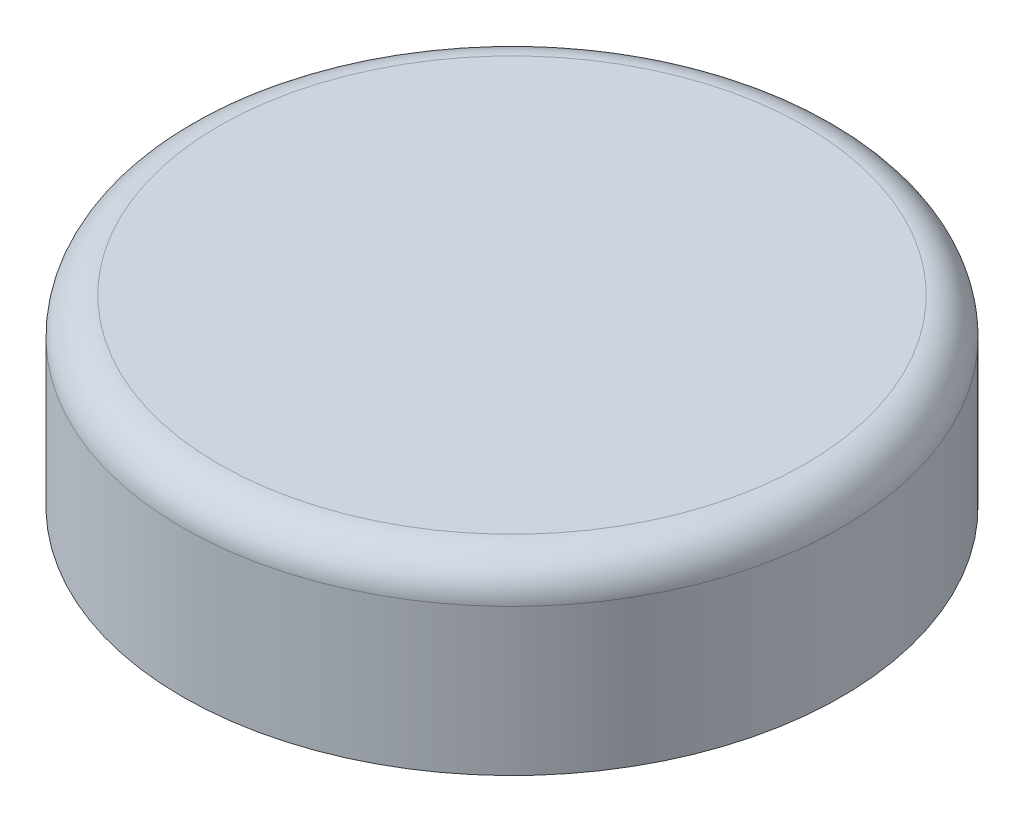
ISO-10303-21;
HEADER;
FILE_DESCRIPTION(('STEP AP214'),'2;1');
FILE_NAME('part.step','',(''),(''),'','','');
FILE_SCHEMA(('AUTOMOTIVE_DESIGN { 1 0 10303 214 1 1 1 1 }'));
ENDSEC;
DATA;
#1=APPLICATION_CONTEXT('core data for automotive mechanical design processes');
#2=APPLICATION_PROTOCOL_DEFINITION('international standard','automotive_design',2000,#1);
#3=PRODUCT_CONTEXT('',#1,'mechanical');
#4=PRODUCT('Part','Part','',(#3));
#5=PRODUCT_RELATED_PRODUCT_CATEGORY('part','',(#4));
#6=PRODUCT_DEFINITION_FORMATION('','',#4);
#7=PRODUCT_DEFINITION_CONTEXT('part definition',#1,'design');
#8=PRODUCT_DEFINITION('design','',#6,#7);
#9=PRODUCT_DEFINITION_SHAPE('','',#8);
#10=(LENGTH_UNIT() NAMED_UNIT(*) SI_UNIT(.MILLI.,.METRE.));
#11=(NAMED_UNIT(*) PLANE_ANGLE_UNIT() SI_UNIT($,.RADIAN.));
#12=(NAMED_UNIT(*) SI_UNIT($,.STERADIAN.) SOLID_ANGLE_UNIT());
#13=UNCERTAINTY_MEASURE_WITH_UNIT(LENGTH_MEASURE(1.E-05),#10,'distance_accuracy_value','');
#14=(GEOMETRIC_REPRESENTATION_CONTEXT(3) GLOBAL_UNCERTAINTY_ASSIGNED_CONTEXT((#13)) GLOBAL_UNIT_ASSIGNED_CONTEXT((#10,
#11,#12)) REPRESENTATION_CONTEXT('',''));
#15=CARTESIAN_POINT('',(0.,0.,0.));
#16=DIRECTION('',(0.,0.,1.));
#17=DIRECTION('',(1.,0.,0.));
#18=AXIS2_PLACEMENT_3D('',#15,#16,#17);
#19=CARTESIAN_POINT('',(0.,5.,0.));
#20=DIRECTION('',(0.,-1.,0.));
#21=DIRECTION('',(0.,0.,-1.));
#22=AXIS2_PLACEMENT_3D('',#19,#20,#21);
#23=CYLINDRICAL_SURFACE('',#22,9.);
#24=CARTESIAN_POINT('',(0.,4.,0.));
#25=DIRECTION('',(0.,1.,0.));
#26=DIRECTION('',(0.,0.,1.));
#27=AXIS2_PLACEMENT_3D('',#24,#25,#26);
#28=CIRCLE('',#27,9.);
#29=CARTESIAN_POINT('',(0.,4.,9.));
#30=VERTEX_POINT('',#29);
#31=EDGE_CURVE('E10',#30,#30,#28,.F.);
#32=ORIENTED_EDGE('',*,*,#31,.T.);
#33=EDGE_LOOP('',(#32));
#34=FACE_BOUND('',#33,.T.);
#35=CARTESIAN_POINT('',(0.,0.,0.));
#36=DIRECTION('',(0.,1.,0.));
#37=DIRECTION('',(0.,0.,1.));
#38=AXIS2_PLACEMENT_3D('',#35,#36,#37);
#39=CIRCLE('',#38,9.);
#40=CARTESIAN_POINT('',(0.,0.,9.));
#41=VERTEX_POINT('',#40);
#42=EDGE_CURVE('E42',#41,#41,#39,.T.);
#43=ORIENTED_EDGE('',*,*,#42,.T.);
#44=EDGE_LOOP('',(#43));
#45=FACE_BOUND('',#44,.T.);
#46=ADVANCED_FACE('F31',(#34,#45),#23,.T.);
#47=CARTESIAN_POINT('',(0.,5.,0.));
#48=DIRECTION('',(0.,1.,0.));
#49=DIRECTION('',(0.,0.,1.));
#50=AXIS2_PLACEMENT_3D('',#47,#48,#49);
#51=PLANE('',#50);
#52=CARTESIAN_POINT('',(0.,5.,0.));
#53=DIRECTION('',(0.,1.,0.));
#54=DIRECTION('',(0.,0.,1.));
#55=AXIS2_PLACEMENT_3D('',#52,#53,#54);
#56=CIRCLE('',#55,8.);
#57=CARTESIAN_POINT('',(0.,5.,8.));
#58=VERTEX_POINT('',#57);
#59=EDGE_CURVE('E38',#58,#58,#56,.T.);
#60=ORIENTED_EDGE('',*,*,#59,.T.);
#61=EDGE_LOOP('',(#60));
#62=FACE_BOUND('',#61,.T.);
#63=ADVANCED_FACE('F52',(#62),#51,.T.);
#64=CARTESIAN_POINT('',(0.,0.,0.));
#65=DIRECTION('',(0.,1.,0.));
#66=DIRECTION('',(0.,0.,1.));
#67=AXIS2_PLACEMENT_3D('',#64,#65,#66);
#68=PLANE('',#67);
#69=ORIENTED_EDGE('',*,*,#42,.F.);
#70=EDGE_LOOP('',(#69));
#71=FACE_BOUND('',#70,.T.);
#72=ADVANCED_FACE('F50',(#71),#68,.F.);
#73=CARTESIAN_POINT('',(0.,4.,0.));
#74=DIRECTION('',(0.,1.,0.));
#75=DIRECTION('',(0.,0.,1.));
#76=AXIS2_PLACEMENT_3D('',#73,#74,#75);
#77=TOROIDAL_SURFACE('',#76,8.,1.);
#78=ORIENTED_EDGE('',*,*,#31,.F.);
#79=EDGE_LOOP('',(#78));
#80=FACE_BOUND('',#79,.T.);
#81=ORIENTED_EDGE('',*,*,#59,.F.);
#82=EDGE_LOOP('',(#81));
#83=FACE_BOUND('',#82,.T.);
#84=ADVANCED_FACE('F33',(#80,#83),#77,.T.);
#85=CLOSED_SHELL('',(#46,#63,#72,#84));
#86=MANIFOLD_SOLID_BREP('B2',#85);
#87=ADVANCED_BREP_SHAPE_REPRESENTATION('',(#18,#86),#14);
#88=SHAPE_DEFINITION_REPRESENTATION(#9,#87);
ENDSEC;
END-ISO-10303-21;
